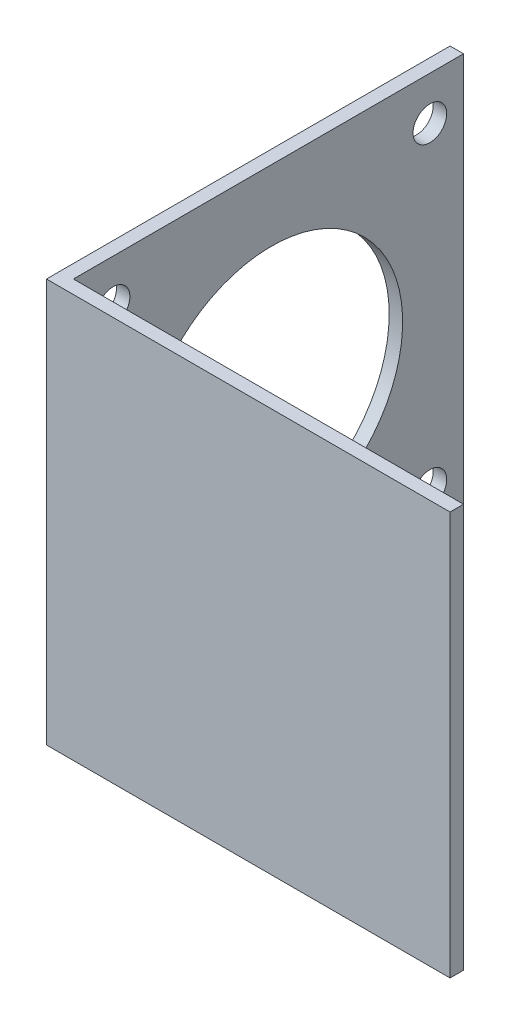
ISO-10303-21;
HEADER;
FILE_DESCRIPTION(('STEP AP214'),'2;1');
FILE_NAME('part.step','',(''),(''),'','','');
FILE_SCHEMA(('AUTOMOTIVE_DESIGN { 1 0 10303 214 1 1 1 1 }'));
ENDSEC;
DATA;
#1=APPLICATION_CONTEXT('core data for automotive mechanical design processes');
#2=APPLICATION_PROTOCOL_DEFINITION('international standard','automotive_design',2000,#1);
#3=PRODUCT_CONTEXT('',#1,'mechanical');
#4=PRODUCT('Part','Part','',(#3));
#5=PRODUCT_RELATED_PRODUCT_CATEGORY('part','',(#4));
#6=PRODUCT_DEFINITION_FORMATION('','',#4);
#7=PRODUCT_DEFINITION_CONTEXT('part definition',#1,'design');
#8=PRODUCT_DEFINITION('design','',#6,#7);
#9=PRODUCT_DEFINITION_SHAPE('','',#8);
#10=(LENGTH_UNIT() NAMED_UNIT(*) SI_UNIT(.MILLI.,.METRE.));
#11=(NAMED_UNIT(*) PLANE_ANGLE_UNIT() SI_UNIT($,.RADIAN.));
#12=(NAMED_UNIT(*) SI_UNIT($,.STERADIAN.) SOLID_ANGLE_UNIT());
#13=UNCERTAINTY_MEASURE_WITH_UNIT(LENGTH_MEASURE(1.E-05),#10,'distance_accuracy_value','');
#14=(GEOMETRIC_REPRESENTATION_CONTEXT(3) GLOBAL_UNCERTAINTY_ASSIGNED_CONTEXT((#13)) GLOBAL_UNIT_ASSIGNED_CONTEXT((#10,
#11,#12)) REPRESENTATION_CONTEXT('',''));
#15=CARTESIAN_POINT('',(0.,0.,0.));
#16=DIRECTION('',(0.,0.,1.));
#17=DIRECTION('',(1.,0.,0.));
#18=AXIS2_PLACEMENT_3D('',#15,#16,#17);
#19=CARTESIAN_POINT('',(0.,60.,-60.));
#20=DIRECTION('',(0.,0.,1.));
#21=DIRECTION('',(1.,0.,0.));
#22=AXIS2_PLACEMENT_3D('',#19,#20,#21);
#23=PLANE('',#22);
#24=DIRECTION('',(-1.,0.,0.));
#25=VECTOR('',#24,1.);
#26=CARTESIAN_POINT('',(0.,0.,-60.));
#27=LINE('',#26,#25);
#28=CARTESIAN_POINT('',(1.99999999999999,0.,-60.));
#29=VERTEX_POINT('',#28);
#30=CARTESIAN_POINT('',(0.,0.,-60.));
#31=VERTEX_POINT('',#30);
#32=EDGE_CURVE('E120',#29,#31,#27,.T.);
#33=ORIENTED_EDGE('',*,*,#32,.T.);
#34=DIRECTION('',(0.,-1.,0.));
#35=VECTOR('',#34,1.);
#36=CARTESIAN_POINT('',(0.,60.,-60.));
#37=LINE('',#36,#35);
#38=CARTESIAN_POINT('',(0.,60.,-60.));
#39=VERTEX_POINT('',#38);
#40=EDGE_CURVE('E11',#39,#31,#37,.T.);
#41=ORIENTED_EDGE('',*,*,#40,.F.);
#42=DIRECTION('',(-1.,0.,0.));
#43=VECTOR('',#42,1.);
#44=CARTESIAN_POINT('',(0.,60.,-60.));
#45=LINE('',#44,#43);
#46=CARTESIAN_POINT('',(1.99999999999999,60.,-60.));
#47=VERTEX_POINT('',#46);
#48=EDGE_CURVE('E131',#47,#39,#45,.T.);
#49=ORIENTED_EDGE('',*,*,#48,.F.);
#50=DIRECTION('',(0.,-1.,0.));
#51=VECTOR('',#50,1.);
#52=CARTESIAN_POINT('',(1.99999999999999,60.,-60.));
#53=LINE('',#52,#51);
#54=EDGE_CURVE('E116',#47,#29,#53,.T.);
#55=ORIENTED_EDGE('',*,*,#54,.T.);
#56=EDGE_LOOP('',(#33,#41,#49,#55));
#57=FACE_BOUND('',#56,.T.);
#58=ADVANCED_FACE('F34',(#57),#23,.F.);
#59=CARTESIAN_POINT('',(0.,60.,-60.));
#60=DIRECTION('',(1.,0.,0.));
#61=DIRECTION('',(0.,0.,-1.));
#62=AXIS2_PLACEMENT_3D('',#59,#60,#61);
#63=PLANE('',#62);
#64=CARTESIAN_POINT('',(0.,6.45000000000025,-54.9999999999996));
#65=DIRECTION('',(1.,0.,0.));
#66=DIRECTION('',(0.,0.,-1.));
#67=AXIS2_PLACEMENT_3D('',#64,#65,#66);
#68=CIRCLE('',#67,2.5);
#69=CARTESIAN_POINT('',(0.,6.45000000000025,-57.4999999999996));
#70=VERTEX_POINT('',#69);
#71=EDGE_CURVE('E124',#70,#70,#68,.T.);
#72=ORIENTED_EDGE('',*,*,#71,.T.);
#73=EDGE_LOOP('',(#72));
#74=FACE_BOUND('',#73,.T.);
#75=CARTESIAN_POINT('',(0.,6.45000000000049,-7.89999999999953));
#76=DIRECTION('',(1.,0.,0.));
#77=DIRECTION('',(0.,0.,-1.));
#78=AXIS2_PLACEMENT_3D('',#75,#76,#77);
#79=CIRCLE('',#78,2.50000000000001);
#80=CARTESIAN_POINT('',(0.,6.45000000000049,-10.3999999999995));
#81=VERTEX_POINT('',#80);
#82=EDGE_CURVE('E150',#81,#81,#79,.T.);
#83=ORIENTED_EDGE('',*,*,#82,.T.);
#84=EDGE_LOOP('',(#83));
#85=FACE_BOUND('',#84,.T.);
#86=CARTESIAN_POINT('',(0.,53.5500000000006,-7.89999999999993));
#87=DIRECTION('',(1.,0.,0.));
#88=DIRECTION('',(0.,0.,-1.));
#89=AXIS2_PLACEMENT_3D('',#86,#87,#88);
#90=CIRCLE('',#89,2.5);
#91=CARTESIAN_POINT('',(0.,53.5500000000006,-10.3999999999999));
#92=VERTEX_POINT('',#91);
#93=EDGE_CURVE('E147',#92,#92,#90,.T.);
#94=ORIENTED_EDGE('',*,*,#93,.T.);
#95=EDGE_LOOP('',(#94));
#96=FACE_BOUND('',#95,.T.);
#97=CARTESIAN_POINT('',(0.,53.55,-55.));
#98=DIRECTION('',(1.,0.,0.));
#99=DIRECTION('',(0.,0.,-1.));
#100=AXIS2_PLACEMENT_3D('',#97,#98,#99);
#101=CIRCLE('',#100,2.5);
#102=CARTESIAN_POINT('',(0.,53.55,-57.5));
#103=VERTEX_POINT('',#102);
#104=EDGE_CURVE('E144',#103,#103,#101,.T.);
#105=ORIENTED_EDGE('',*,*,#104,.T.);
#106=EDGE_LOOP('',(#105));
#107=FACE_BOUND('',#106,.T.);
#108=CARTESIAN_POINT('',(0.,30.,-31.45));
#109=DIRECTION('',(1.,0.,0.));
#110=DIRECTION('',(0.,0.,-1.));
#111=AXIS2_PLACEMENT_3D('',#108,#109,#110);
#112=CIRCLE('',#111,19.5);
#113=CARTESIAN_POINT('',(0.,30.,-50.95));
#114=VERTEX_POINT('',#113);
#115=EDGE_CURVE('E140',#114,#114,#112,.T.);
#116=ORIENTED_EDGE('',*,*,#115,.T.);
#117=EDGE_LOOP('',(#116));
#118=FACE_BOUND('',#117,.T.);
#119=DIRECTION('',(0.,0.,1.));
#120=VECTOR('',#119,1.);
#121=CARTESIAN_POINT('',(0.,0.,-60.));
#122=LINE('',#121,#120);
#123=CARTESIAN_POINT('',(0.,0.,0.));
#124=VERTEX_POINT('',#123);
#125=EDGE_CURVE('E123',#31,#124,#122,.T.);
#126=ORIENTED_EDGE('',*,*,#125,.T.);
#127=DIRECTION('',(0.,-1.,0.));
#128=VECTOR('',#127,1.);
#129=CARTESIAN_POINT('',(0.,60.,0.));
#130=LINE('',#129,#128);
#131=CARTESIAN_POINT('',(0.,60.,0.));
#132=VERTEX_POINT('',#131);
#133=EDGE_CURVE('E43',#132,#124,#130,.T.);
#134=ORIENTED_EDGE('',*,*,#133,.F.);
#135=DIRECTION('',(0.,0.,1.));
#136=VECTOR('',#135,1.);
#137=CARTESIAN_POINT('',(0.,60.,-60.));
#138=LINE('',#137,#136);
#139=EDGE_CURVE('E89',#39,#132,#138,.T.);
#140=ORIENTED_EDGE('',*,*,#139,.F.);
#141=ORIENTED_EDGE('',*,*,#40,.T.);
#142=EDGE_LOOP('',(#126,#134,#140,#141));
#143=FACE_BOUND('',#142,.T.);
#144=ADVANCED_FACE('F167',(#74,#85,#96,#107,#118,#143),#63,.F.);
#145=CARTESIAN_POINT('',(0.,60.,0.));
#146=DIRECTION('',(0.,0.,-1.));
#147=DIRECTION('',(-1.,0.,0.));
#148=AXIS2_PLACEMENT_3D('',#145,#146,#147);
#149=PLANE('',#148);
#150=DIRECTION('',(1.,0.,0.));
#151=VECTOR('',#150,1.);
#152=CARTESIAN_POINT('',(0.,0.,0.));
#153=LINE('',#152,#151);
#154=CARTESIAN_POINT('',(60.,0.,0.));
#155=VERTEX_POINT('',#154);
#156=EDGE_CURVE('E126',#124,#155,#153,.T.);
#157=ORIENTED_EDGE('',*,*,#156,.T.);
#158=DIRECTION('',(0.,-1.,0.));
#159=VECTOR('',#158,1.);
#160=CARTESIAN_POINT('',(60.,60.,0.));
#161=LINE('',#160,#159);
#162=CARTESIAN_POINT('',(60.,60.,0.));
#163=VERTEX_POINT('',#162);
#164=EDGE_CURVE('E111',#163,#155,#161,.T.);
#165=ORIENTED_EDGE('',*,*,#164,.F.);
#166=DIRECTION('',(1.,0.,0.));
#167=VECTOR('',#166,1.);
#168=CARTESIAN_POINT('',(0.,60.,0.));
#169=LINE('',#168,#167);
#170=EDGE_CURVE('E102',#132,#163,#169,.T.);
#171=ORIENTED_EDGE('',*,*,#170,.F.);
#172=ORIENTED_EDGE('',*,*,#133,.T.);
#173=EDGE_LOOP('',(#157,#165,#171,#172));
#174=FACE_BOUND('',#173,.T.);
#175=ADVANCED_FACE('F170',(#174),#149,.F.);
#176=CARTESIAN_POINT('',(60.,60.,-2.));
#177=DIRECTION('',(-1.,0.,0.));
#178=DIRECTION('',(0.,0.,1.));
#179=AXIS2_PLACEMENT_3D('',#176,#177,#178);
#180=PLANE('',#179);
#181=DIRECTION('',(0.,0.,-1.));
#182=VECTOR('',#181,1.);
#183=CARTESIAN_POINT('',(60.,0.,-2.));
#184=LINE('',#183,#182);
#185=CARTESIAN_POINT('',(60.,0.,-2.));
#186=VERTEX_POINT('',#185);
#187=EDGE_CURVE('E110',#155,#186,#184,.T.);
#188=ORIENTED_EDGE('',*,*,#187,.T.);
#189=DIRECTION('',(0.,-1.,0.));
#190=VECTOR('',#189,1.);
#191=CARTESIAN_POINT('',(60.,60.,-2.));
#192=LINE('',#191,#190);
#193=CARTESIAN_POINT('',(60.,60.,-2.));
#194=VERTEX_POINT('',#193);
#195=EDGE_CURVE('E107',#194,#186,#192,.T.);
#196=ORIENTED_EDGE('',*,*,#195,.F.);
#197=DIRECTION('',(0.,0.,-1.));
#198=VECTOR('',#197,1.);
#199=CARTESIAN_POINT('',(60.,60.,-2.));
#200=LINE('',#199,#198);
#201=EDGE_CURVE('E96',#163,#194,#200,.T.);
#202=ORIENTED_EDGE('',*,*,#201,.F.);
#203=ORIENTED_EDGE('',*,*,#164,.T.);
#204=EDGE_LOOP('',(#188,#196,#202,#203));
#205=FACE_BOUND('',#204,.T.);
#206=ADVANCED_FACE('F108',(#205),#180,.F.);
#207=CARTESIAN_POINT('',(2.,60.,-2.));
#208=DIRECTION('',(0.,0.,1.));
#209=DIRECTION('',(1.,0.,0.));
#210=AXIS2_PLACEMENT_3D('',#207,#208,#209);
#211=PLANE('',#210);
#212=DIRECTION('',(-1.,0.,0.));
#213=VECTOR('',#212,1.);
#214=CARTESIAN_POINT('',(2.,0.,-2.));
#215=LINE('',#214,#213);
#216=CARTESIAN_POINT('',(2.,0.,-2.));
#217=VERTEX_POINT('',#216);
#218=EDGE_CURVE('E75',#186,#217,#215,.T.);
#219=ORIENTED_EDGE('',*,*,#218,.T.);
#220=DIRECTION('',(0.,-1.,0.));
#221=VECTOR('',#220,1.);
#222=CARTESIAN_POINT('',(2.,60.,-2.));
#223=LINE('',#222,#221);
#224=CARTESIAN_POINT('',(2.,60.,-2.));
#225=VERTEX_POINT('',#224);
#226=EDGE_CURVE('E112',#225,#217,#223,.T.);
#227=ORIENTED_EDGE('',*,*,#226,.F.);
#228=DIRECTION('',(-1.,0.,0.));
#229=VECTOR('',#228,1.);
#230=CARTESIAN_POINT('',(2.,60.,-2.));
#231=LINE('',#230,#229);
#232=EDGE_CURVE('E100',#194,#225,#231,.T.);
#233=ORIENTED_EDGE('',*,*,#232,.F.);
#234=ORIENTED_EDGE('',*,*,#195,.T.);
#235=EDGE_LOOP('',(#219,#227,#233,#234));
#236=FACE_BOUND('',#235,.T.);
#237=ADVANCED_FACE('F114',(#236),#211,.F.);
#238=CARTESIAN_POINT('',(1.99999999999999,60.,-60.));
#239=DIRECTION('',(-1.,0.,0.));
#240=DIRECTION('',(0.,0.,1.));
#241=AXIS2_PLACEMENT_3D('',#238,#239,#240);
#242=PLANE('',#241);
#243=CARTESIAN_POINT('',(1.99999999999999,6.45000000000025,-54.9999999999996));
#244=DIRECTION('',(-1.,0.,0.));
#245=DIRECTION('',(0.,0.,1.));
#246=AXIS2_PLACEMENT_3D('',#243,#244,#245);
#247=CIRCLE('',#246,2.5);
#248=CARTESIAN_POINT('',(2.,6.45000000000025,-52.4999999999996));
#249=VERTEX_POINT('',#248);
#250=EDGE_CURVE('E37',#249,#249,#247,.T.);
#251=ORIENTED_EDGE('',*,*,#250,.T.);
#252=EDGE_LOOP('',(#251));
#253=FACE_BOUND('',#252,.T.);
#254=CARTESIAN_POINT('',(2.,6.45000000000049,-7.89999999999953));
#255=DIRECTION('',(-1.,0.,0.));
#256=DIRECTION('',(0.,0.,1.));
#257=AXIS2_PLACEMENT_3D('',#254,#255,#256);
#258=CIRCLE('',#257,2.50000000000001);
#259=CARTESIAN_POINT('',(2.,6.45000000000049,-5.39999999999952));
#260=VERTEX_POINT('',#259);
#261=EDGE_CURVE('E148',#260,#260,#258,.T.);
#262=ORIENTED_EDGE('',*,*,#261,.T.);
#263=EDGE_LOOP('',(#262));
#264=FACE_BOUND('',#263,.T.);
#265=CARTESIAN_POINT('',(2.,53.5500000000006,-7.89999999999993));
#266=DIRECTION('',(-1.,0.,0.));
#267=DIRECTION('',(0.,0.,1.));
#268=AXIS2_PLACEMENT_3D('',#265,#266,#267);
#269=CIRCLE('',#268,2.5);
#270=CARTESIAN_POINT('',(2.,53.5500000000006,-5.39999999999994));
#271=VERTEX_POINT('',#270);
#272=EDGE_CURVE('E145',#271,#271,#269,.T.);
#273=ORIENTED_EDGE('',*,*,#272,.T.);
#274=EDGE_LOOP('',(#273));
#275=FACE_BOUND('',#274,.T.);
#276=CARTESIAN_POINT('',(1.99999999999999,53.55,-55.));
#277=DIRECTION('',(-1.,0.,0.));
#278=DIRECTION('',(0.,0.,1.));
#279=AXIS2_PLACEMENT_3D('',#276,#277,#278);
#280=CIRCLE('',#279,2.5);
#281=CARTESIAN_POINT('',(2.,53.55,-52.5));
#282=VERTEX_POINT('',#281);
#283=EDGE_CURVE('E141',#282,#282,#280,.T.);
#284=ORIENTED_EDGE('',*,*,#283,.T.);
#285=EDGE_LOOP('',(#284));
#286=FACE_BOUND('',#285,.T.);
#287=CARTESIAN_POINT('',(1.99999999999999,30.,-31.45));
#288=DIRECTION('',(-1.,0.,0.));
#289=DIRECTION('',(0.,0.,1.));
#290=AXIS2_PLACEMENT_3D('',#287,#288,#289);
#291=CIRCLE('',#290,19.5);
#292=CARTESIAN_POINT('',(2.,30.,-11.95));
#293=VERTEX_POINT('',#292);
#294=EDGE_CURVE('E137',#293,#293,#291,.T.);
#295=ORIENTED_EDGE('',*,*,#294,.T.);
#296=EDGE_LOOP('',(#295));
#297=FACE_BOUND('',#296,.T.);
#298=DIRECTION('',(0.,0.,-1.));
#299=VECTOR('',#298,1.);
#300=CARTESIAN_POINT('',(1.99999999999999,0.,-60.));
#301=LINE('',#300,#299);
#302=EDGE_CURVE('E81',#217,#29,#301,.T.);
#303=ORIENTED_EDGE('',*,*,#302,.T.);
#304=ORIENTED_EDGE('',*,*,#54,.F.);
#305=DIRECTION('',(0.,0.,-1.));
#306=VECTOR('',#305,1.);
#307=CARTESIAN_POINT('',(1.99999999999999,60.,-60.));
#308=LINE('',#307,#306);
#309=EDGE_CURVE('E52',#225,#47,#308,.T.);
#310=ORIENTED_EDGE('',*,*,#309,.F.);
#311=ORIENTED_EDGE('',*,*,#226,.T.);
#312=EDGE_LOOP('',(#303,#304,#310,#311));
#313=FACE_BOUND('',#312,.T.);
#314=ADVANCED_FACE('F175',(#253,#264,#275,#286,#297,#313),#242,.F.);
#315=CARTESIAN_POINT('',(0.,60.,0.));
#316=DIRECTION('',(0.,-1.,0.));
#317=DIRECTION('',(0.,0.,-1.));
#318=AXIS2_PLACEMENT_3D('',#315,#316,#317);
#319=PLANE('',#318);
#320=ORIENTED_EDGE('',*,*,#48,.T.);
#321=ORIENTED_EDGE('',*,*,#139,.T.);
#322=ORIENTED_EDGE('',*,*,#170,.T.);
#323=ORIENTED_EDGE('',*,*,#201,.T.);
#324=ORIENTED_EDGE('',*,*,#232,.T.);
#325=ORIENTED_EDGE('',*,*,#309,.T.);
#326=EDGE_LOOP('',(#320,#321,#322,#323,#324,#325));
#327=FACE_BOUND('',#326,.T.);
#328=ADVANCED_FACE('F98',(#327),#319,.F.);
#329=CARTESIAN_POINT('',(0.,0.,0.));
#330=DIRECTION('',(0.,-1.,0.));
#331=DIRECTION('',(0.,0.,-1.));
#332=AXIS2_PLACEMENT_3D('',#329,#330,#331);
#333=PLANE('',#332);
#334=ORIENTED_EDGE('',*,*,#32,.F.);
#335=ORIENTED_EDGE('',*,*,#302,.F.);
#336=ORIENTED_EDGE('',*,*,#218,.F.);
#337=ORIENTED_EDGE('',*,*,#187,.F.);
#338=ORIENTED_EDGE('',*,*,#156,.F.);
#339=ORIENTED_EDGE('',*,*,#125,.F.);
#340=EDGE_LOOP('',(#334,#335,#336,#337,#338,#339));
#341=FACE_BOUND('',#340,.T.);
#342=ADVANCED_FACE('F173',(#341),#333,.T.);
#343=CARTESIAN_POINT('',(60.,30.,-31.45));
#344=DIRECTION('',(-1.,0.,0.));
#345=DIRECTION('',(0.,0.,1.));
#346=AXIS2_PLACEMENT_3D('',#343,#344,#345);
#347=CYLINDRICAL_SURFACE('',#346,19.5);
#348=ORIENTED_EDGE('',*,*,#294,.F.);
#349=EDGE_LOOP('',(#348));
#350=FACE_BOUND('',#349,.T.);
#351=ORIENTED_EDGE('',*,*,#115,.F.);
#352=EDGE_LOOP('',(#351));
#353=FACE_BOUND('',#352,.T.);
#354=ADVANCED_FACE('F222',(#350,#353),#347,.F.);
#355=CARTESIAN_POINT('',(60.,53.55,-55.));
#356=DIRECTION('',(-1.,0.,0.));
#357=DIRECTION('',(0.,0.,1.));
#358=AXIS2_PLACEMENT_3D('',#355,#356,#357);
#359=CYLINDRICAL_SURFACE('',#358,2.5);
#360=ORIENTED_EDGE('',*,*,#283,.F.);
#361=EDGE_LOOP('',(#360));
#362=FACE_BOUND('',#361,.T.);
#363=ORIENTED_EDGE('',*,*,#104,.F.);
#364=EDGE_LOOP('',(#363));
#365=FACE_BOUND('',#364,.T.);
#366=ADVANCED_FACE('F240',(#362,#365),#359,.F.);
#367=CARTESIAN_POINT('',(60.,53.5500000000006,-7.89999999999994));
#368=DIRECTION('',(-1.,0.,0.));
#369=DIRECTION('',(0.,0.,1.));
#370=AXIS2_PLACEMENT_3D('',#367,#368,#369);
#371=CYLINDRICAL_SURFACE('',#370,2.5);
#372=ORIENTED_EDGE('',*,*,#272,.F.);
#373=EDGE_LOOP('',(#372));
#374=FACE_BOUND('',#373,.T.);
#375=ORIENTED_EDGE('',*,*,#93,.F.);
#376=EDGE_LOOP('',(#375));
#377=FACE_BOUND('',#376,.T.);
#378=ADVANCED_FACE('F250',(#374,#377),#371,.F.);
#379=CARTESIAN_POINT('',(60.,6.45000000000049,-7.89999999999953));
#380=DIRECTION('',(-1.,0.,0.));
#381=DIRECTION('',(0.,0.,1.));
#382=AXIS2_PLACEMENT_3D('',#379,#380,#381);
#383=CYLINDRICAL_SURFACE('',#382,2.50000000000001);
#384=ORIENTED_EDGE('',*,*,#261,.F.);
#385=EDGE_LOOP('',(#384));
#386=FACE_BOUND('',#385,.T.);
#387=ORIENTED_EDGE('',*,*,#82,.F.);
#388=EDGE_LOOP('',(#387));
#389=FACE_BOUND('',#388,.T.);
#390=ADVANCED_FACE('F260',(#386,#389),#383,.F.);
#391=CARTESIAN_POINT('',(60.,6.45000000000025,-54.9999999999996));
#392=DIRECTION('',(-1.,0.,0.));
#393=DIRECTION('',(0.,0.,1.));
#394=AXIS2_PLACEMENT_3D('',#391,#392,#393);
#395=CYLINDRICAL_SURFACE('',#394,2.5);
#396=ORIENTED_EDGE('',*,*,#250,.F.);
#397=EDGE_LOOP('',(#396));
#398=FACE_BOUND('',#397,.T.);
#399=ORIENTED_EDGE('',*,*,#71,.F.);
#400=EDGE_LOOP('',(#399));
#401=FACE_BOUND('',#400,.T.);
#402=ADVANCED_FACE('F270',(#398,#401),#395,.F.);
#403=CLOSED_SHELL('',(#58,#144,#175,#206,#237,#314,#328,#342,#354,#366,#378,#390,#402));
#404=MANIFOLD_SOLID_BREP('B2',#403);
#405=ADVANCED_BREP_SHAPE_REPRESENTATION('',(#18,#404),#14);
#406=SHAPE_DEFINITION_REPRESENTATION(#9,#405);
ENDSEC;
END-ISO-10303-21;
